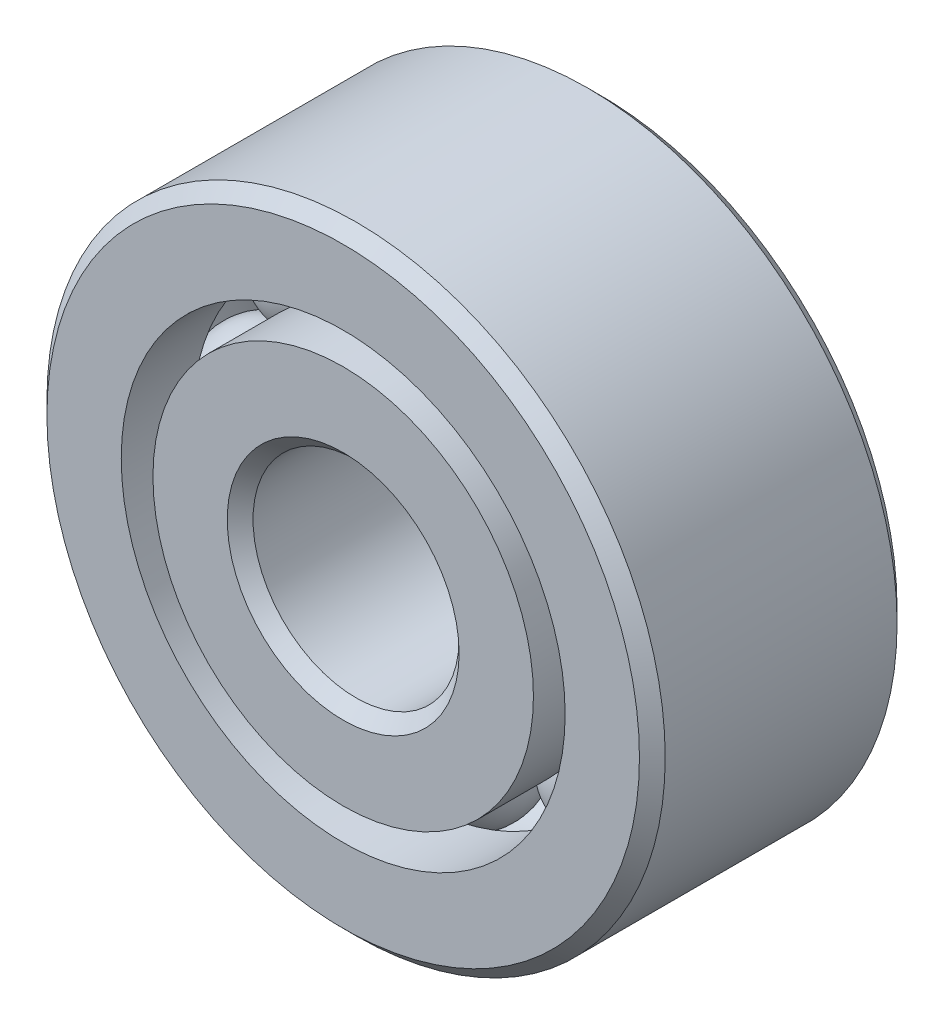
ISO-10303-21;
HEADER;
FILE_DESCRIPTION(('STEP AP214'),'2;1');
FILE_NAME('part.step','',(''),(''),'','','');
FILE_SCHEMA(('AUTOMOTIVE_DESIGN { 1 0 10303 214 1 1 1 1 }'));
ENDSEC;
DATA;
#1=APPLICATION_CONTEXT('core data for automotive mechanical design processes');
#2=APPLICATION_PROTOCOL_DEFINITION('international standard','automotive_design',2000,#1);
#3=PRODUCT_CONTEXT('',#1,'mechanical');
#4=PRODUCT('Part','Part','',(#3));
#5=PRODUCT_RELATED_PRODUCT_CATEGORY('part','',(#4));
#6=PRODUCT_DEFINITION_FORMATION('','',#4);
#7=PRODUCT_DEFINITION_CONTEXT('part definition',#1,'design');
#8=PRODUCT_DEFINITION('design','',#6,#7);
#9=PRODUCT_DEFINITION_SHAPE('','',#8);
#10=(LENGTH_UNIT() NAMED_UNIT(*) SI_UNIT(.MILLI.,.METRE.));
#11=(NAMED_UNIT(*) PLANE_ANGLE_UNIT() SI_UNIT($,.RADIAN.));
#12=(NAMED_UNIT(*) SI_UNIT($,.STERADIAN.) SOLID_ANGLE_UNIT());
#13=UNCERTAINTY_MEASURE_WITH_UNIT(LENGTH_MEASURE(1.E-05),#10,'distance_accuracy_value','');
#14=(GEOMETRIC_REPRESENTATION_CONTEXT(3) GLOBAL_UNCERTAINTY_ASSIGNED_CONTEXT((#13)) GLOBAL_UNIT_ASSIGNED_CONTEXT((#10,
#11,#12)) REPRESENTATION_CONTEXT('',''));
#15=CARTESIAN_POINT('',(0.,0.,0.));
#16=DIRECTION('',(0.,0.,1.));
#17=DIRECTION('',(1.,0.,0.));
#18=AXIS2_PLACEMENT_3D('',#15,#16,#17);
#19=CARTESIAN_POINT('',(-2.24506403026726,2.24506403026731,0.));
#20=DIRECTION('',(0.,0.,1.));
#21=DIRECTION('',(-0.707106781186539,0.707106781186556,0.));
#22=AXIS2_PLACEMENT_3D('',#19,#20,#21);
#23=SPHERICAL_SURFACE('',#22,0.915136422466877);
#24=CARTESIAN_POINT('',(-2.24506403026726,2.24506403026731,0.915136422466874));
#25=VERTEX_POINT('',#24);
#26=VERTEX_LOOP('',#25);
#27=FACE_BOUND('',#26,.T.);
#28=ADVANCED_FACE('F41',(#27),#23,.T.);
#29=CLOSED_SHELL('',(#28));
#30=MANIFOLD_SOLID_BREP('B2',#29);
#31=CARTESIAN_POINT('',(-3.175,0.,0.));
#32=DIRECTION('',(0.,0.,1.));
#33=DIRECTION('',(-1.,0.,0.));
#34=AXIS2_PLACEMENT_3D('',#31,#32,#33);
#35=SPHERICAL_SURFACE('',#34,0.915136422466877);
#36=CARTESIAN_POINT('',(-3.175,0.,0.915136422466874));
#37=VERTEX_POINT('',#36);
#38=VERTEX_LOOP('',#37);
#39=FACE_BOUND('',#38,.T.);
#40=ADVANCED_FACE('F61',(#39),#35,.T.);
#41=CLOSED_SHELL('',(#40));
#42=MANIFOLD_SOLID_BREP('B6',#41);
#43=CARTESIAN_POINT('',(-2.24506403026731,-2.24506403026727,0.));
#44=DIRECTION('',(0.,0.,1.));
#45=DIRECTION('',(-0.707106781186554,-0.707106781186541,0.));
#46=AXIS2_PLACEMENT_3D('',#43,#44,#45);
#47=SPHERICAL_SURFACE('',#46,0.915136422466877);
#48=CARTESIAN_POINT('',(-2.24506403026731,-2.24506403026727,0.915136422466874));
#49=VERTEX_POINT('',#48);
#50=VERTEX_LOOP('',#49);
#51=FACE_BOUND('',#50,.T.);
#52=ADVANCED_FACE('F81',(#51),#47,.T.);
#53=CLOSED_SHELL('',(#52));
#54=MANIFOLD_SOLID_BREP('B37',#53);
#55=CARTESIAN_POINT('',(0.,-3.175,0.));
#56=DIRECTION('',(0.,0.,1.));
#57=DIRECTION('',(0.,-1.,0.));
#58=AXIS2_PLACEMENT_3D('',#55,#56,#57);
#59=SPHERICAL_SURFACE('',#58,0.915136422466877);
#60=CARTESIAN_POINT('',(0.,-3.175,0.915136422466874));
#61=VERTEX_POINT('',#60);
#62=VERTEX_LOOP('',#61);
#63=FACE_BOUND('',#62,.T.);
#64=ADVANCED_FACE('F101',(#63),#59,.T.);
#65=CLOSED_SHELL('',(#64));
#66=MANIFOLD_SOLID_BREP('B57',#65);
#67=CARTESIAN_POINT('',(2.24506403026727,-2.2450640302673,0.));
#68=DIRECTION('',(0.,0.,1.));
#69=DIRECTION('',(0.707106781186544,-0.707106781186551,0.));
#70=AXIS2_PLACEMENT_3D('',#67,#68,#69);
#71=SPHERICAL_SURFACE('',#70,0.915136422466877);
#72=CARTESIAN_POINT('',(2.24506403026727,-2.2450640302673,0.915136422466874));
#73=VERTEX_POINT('',#72);
#74=VERTEX_LOOP('',#73);
#75=FACE_BOUND('',#74,.T.);
#76=ADVANCED_FACE('F121',(#75),#71,.T.);
#77=CLOSED_SHELL('',(#76));
#78=MANIFOLD_SOLID_BREP('B77',#77);
#79=CARTESIAN_POINT('',(3.175,0.,0.));
#80=DIRECTION('',(0.,0.,1.));
#81=DIRECTION('',(1.,0.,0.));
#82=AXIS2_PLACEMENT_3D('',#79,#80,#81);
#83=SPHERICAL_SURFACE('',#82,0.915136422466877);
#84=CARTESIAN_POINT('',(3.175,0.,0.915136422466874));
#85=VERTEX_POINT('',#84);
#86=VERTEX_LOOP('',#85);
#87=FACE_BOUND('',#86,.T.);
#88=ADVANCED_FACE('F141',(#87),#83,.T.);
#89=CLOSED_SHELL('',(#88));
#90=MANIFOLD_SOLID_BREP('B97',#89);
#91=CARTESIAN_POINT('',(2.24506403026729,2.24506403026728,0.));
#92=DIRECTION('',(0.,0.,1.));
#93=DIRECTION('',(0.707106781186549,0.707106781186546,0.));
#94=AXIS2_PLACEMENT_3D('',#91,#92,#93);
#95=SPHERICAL_SURFACE('',#94,0.915136422466877);
#96=CARTESIAN_POINT('',(2.24506403026729,2.24506403026728,0.915136422466874));
#97=VERTEX_POINT('',#96);
#98=VERTEX_LOOP('',#97);
#99=FACE_BOUND('',#98,.T.);
#100=ADVANCED_FACE('F161',(#99),#95,.T.);
#101=CLOSED_SHELL('',(#100));
#102=MANIFOLD_SOLID_BREP('B117',#101);
#103=CARTESIAN_POINT('',(0.,3.175,0.));
#104=DIRECTION('',(0.,0.,1.));
#105=DIRECTION('',(0.,1.,0.));
#106=AXIS2_PLACEMENT_3D('',#103,#104,#105);
#107=SPHERICAL_SURFACE('',#106,0.915136422466877);
#108=CARTESIAN_POINT('',(0.,3.175,0.915136422466874));
#109=VERTEX_POINT('',#108);
#110=VERTEX_LOOP('',#109);
#111=FACE_BOUND('',#110,.T.);
#112=ADVANCED_FACE('F183',(#111),#107,.T.);
#113=CLOSED_SHELL('',(#112));
#114=MANIFOLD_SOLID_BREP('B137',#113);
#115=CARTESIAN_POINT('',(0.,2.93076923076923,1.984375));
#116=DIRECTION('',(0.,0.,-1.));
#117=DIRECTION('',(-1.,0.,0.));
#118=AXIS2_PLACEMENT_3D('',#115,#116,#117);
#119=PLANE('',#118);
#120=CARTESIAN_POINT('',(0.,0.,1.984375));
#121=DIRECTION('',(0.,0.,1.));
#122=DIRECTION('',(1.,0.,0.));
#123=AXIS2_PLACEMENT_3D('',#120,#121,#122);
#124=CIRCLE('',#123,1.7859375);
#125=CARTESIAN_POINT('',(1.7859375,0.,1.984375));
#126=VERTEX_POINT('',#125);
#127=EDGE_CURVE('E230',#126,#126,#124,.T.);
#128=ORIENTED_EDGE('',*,*,#127,.F.);
#129=EDGE_LOOP('',(#128));
#130=FACE_BOUND('',#129,.T.);
#131=CARTESIAN_POINT('',(0.,0.,1.984375));
#132=DIRECTION('',(0.,0.,1.));
#133=DIRECTION('',(1.,0.,0.));
#134=AXIS2_PLACEMENT_3D('',#131,#132,#133);
#135=CIRCLE('',#134,2.93076923076923);
#136=CARTESIAN_POINT('',(2.93076923076923,0.,1.984375));
#137=VERTEX_POINT('',#136);
#138=EDGE_CURVE('E182',#137,#137,#135,.T.);
#139=ORIENTED_EDGE('',*,*,#138,.T.);
#140=EDGE_LOOP('',(#139));
#141=FACE_BOUND('',#140,.T.);
#142=ADVANCED_FACE('F202',(#130,#141),#119,.F.);
#143=CARTESIAN_POINT('',(0.,0.,1.984375));
#144=DIRECTION('',(0.,0.,1.));
#145=DIRECTION('',(1.,0.,0.));
#146=AXIS2_PLACEMENT_3D('',#143,#144,#145);
#147=CYLINDRICAL_SURFACE('',#146,2.93076923076923);
#148=ORIENTED_EDGE('',*,*,#138,.F.);
#149=EDGE_LOOP('',(#148));
#150=FACE_BOUND('',#149,.T.);
#151=CARTESIAN_POINT('',(0.,0.,0.881944444444442));
#152=DIRECTION('',(0.,0.,1.));
#153=DIRECTION('',(1.,0.,0.));
#154=AXIS2_PLACEMENT_3D('',#151,#152,#153);
#155=CIRCLE('',#154,2.93076923076923);
#156=CARTESIAN_POINT('',(2.93076923076923,0.,0.881944444444442));
#157=VERTEX_POINT('',#156);
#158=EDGE_CURVE('E208',#157,#157,#155,.T.);
#159=ORIENTED_EDGE('',*,*,#158,.T.);
#160=EDGE_LOOP('',(#159));
#161=FACE_BOUND('',#160,.T.);
#162=ADVANCED_FACE('F237',(#150,#161),#147,.T.);
#163=CARTESIAN_POINT('',(0.,0.,0.));
#164=DIRECTION('',(0.,0.,1.));
#165=DIRECTION('',(1.,0.,0.));
#166=AXIS2_PLACEMENT_3D('',#163,#164,#165);
#167=TOROIDAL_SURFACE('',#166,3.175,0.915136422466873);
#168=ORIENTED_EDGE('',*,*,#158,.F.);
#169=EDGE_LOOP('',(#168));
#170=FACE_BOUND('',#169,.T.);
#171=CARTESIAN_POINT('',(0.,0.,-0.881944444444445));
#172=DIRECTION('',(0.,0.,1.));
#173=DIRECTION('',(1.,0.,0.));
#174=AXIS2_PLACEMENT_3D('',#171,#172,#173);
#175=CIRCLE('',#174,2.93076923076923);
#176=CARTESIAN_POINT('',(2.93076923076923,0.,-0.881944444444445));
#177=VERTEX_POINT('',#176);
#178=EDGE_CURVE('E212',#177,#177,#175,.T.);
#179=ORIENTED_EDGE('',*,*,#178,.T.);
#180=EDGE_LOOP('',(#179));
#181=FACE_BOUND('',#180,.T.);
#182=ADVANCED_FACE('F241',(#170,#181),#167,.F.);
#183=CARTESIAN_POINT('',(0.,0.,1.984375));
#184=DIRECTION('',(0.,0.,1.));
#185=DIRECTION('',(1.,0.,0.));
#186=AXIS2_PLACEMENT_3D('',#183,#184,#185);
#187=CYLINDRICAL_SURFACE('',#186,2.93076923076923);
#188=ORIENTED_EDGE('',*,*,#178,.F.);
#189=EDGE_LOOP('',(#188));
#190=FACE_BOUND('',#189,.T.);
#191=CARTESIAN_POINT('',(0.,0.,-1.984375));
#192=DIRECTION('',(0.,0.,1.));
#193=DIRECTION('',(1.,0.,0.));
#194=AXIS2_PLACEMENT_3D('',#191,#192,#193);
#195=CIRCLE('',#194,2.93076923076923);
#196=CARTESIAN_POINT('',(2.93076923076923,0.,-1.984375));
#197=VERTEX_POINT('',#196);
#198=EDGE_CURVE('E216',#197,#197,#195,.T.);
#199=ORIENTED_EDGE('',*,*,#198,.T.);
#200=EDGE_LOOP('',(#199));
#201=FACE_BOUND('',#200,.T.);
#202=ADVANCED_FACE('F246',(#190,#201),#187,.T.);
#203=CARTESIAN_POINT('',(0.,1.7859375,-1.984375));
#204=DIRECTION('',(0.,0.,1.));
#205=DIRECTION('',(1.,0.,0.));
#206=AXIS2_PLACEMENT_3D('',#203,#204,#205);
#207=PLANE('',#206);
#208=ORIENTED_EDGE('',*,*,#198,.F.);
#209=EDGE_LOOP('',(#208));
#210=FACE_BOUND('',#209,.T.);
#211=CARTESIAN_POINT('',(0.,0.,-1.98437500000001));
#212=DIRECTION('',(0.,0.,1.));
#213=DIRECTION('',(1.,0.,0.));
#214=AXIS2_PLACEMENT_3D('',#211,#212,#213);
#215=CIRCLE('',#214,1.7859375);
#216=CARTESIAN_POINT('',(1.7859375,0.,-1.98437500000001));
#217=VERTEX_POINT('',#216);
#218=EDGE_CURVE('E221',#217,#217,#215,.T.);
#219=ORIENTED_EDGE('',*,*,#218,.T.);
#220=EDGE_LOOP('',(#219));
#221=FACE_BOUND('',#220,.T.);
#222=ADVANCED_FACE('F252',(#210,#221),#207,.F.);
#223=CARTESIAN_POINT('',(0.,0.,-1.78593750000001));
#224=DIRECTION('',(0.,0.,-1.));
#225=DIRECTION('',(-1.,0.,0.));
#226=AXIS2_PLACEMENT_3D('',#223,#224,#225);
#227=CONICAL_SURFACE('',#226,1.5875,0.785398163397446);
#228=ORIENTED_EDGE('',*,*,#218,.F.);
#229=EDGE_LOOP('',(#228));
#230=FACE_BOUND('',#229,.T.);
#231=CARTESIAN_POINT('',(0.,0.,-1.78593750000001));
#232=DIRECTION('',(0.,0.,1.));
#233=DIRECTION('',(1.,0.,0.));
#234=AXIS2_PLACEMENT_3D('',#231,#232,#233);
#235=CIRCLE('',#234,1.5875);
#236=CARTESIAN_POINT('',(1.5875,0.,-1.78593750000001));
#237=VERTEX_POINT('',#236);
#238=EDGE_CURVE('E224',#237,#237,#235,.T.);
#239=ORIENTED_EDGE('',*,*,#238,.T.);
#240=EDGE_LOOP('',(#239));
#241=FACE_BOUND('',#240,.T.);
#242=ADVANCED_FACE('F256',(#230,#241),#227,.F.);
#243=CARTESIAN_POINT('',(0.,0.,1.984375));
#244=DIRECTION('',(0.,0.,1.));
#245=DIRECTION('',(1.,0.,0.));
#246=AXIS2_PLACEMENT_3D('',#243,#244,#245);
#247=CYLINDRICAL_SURFACE('',#246,1.5875);
#248=ORIENTED_EDGE('',*,*,#238,.F.);
#249=EDGE_LOOP('',(#248));
#250=FACE_BOUND('',#249,.T.);
#251=CARTESIAN_POINT('',(0.,0.,1.7859375));
#252=DIRECTION('',(0.,0.,1.));
#253=DIRECTION('',(1.,0.,0.));
#254=AXIS2_PLACEMENT_3D('',#251,#252,#253);
#255=CIRCLE('',#254,1.5875);
#256=CARTESIAN_POINT('',(1.5875,0.,1.7859375));
#257=VERTEX_POINT('',#256);
#258=EDGE_CURVE('E227',#257,#257,#255,.T.);
#259=ORIENTED_EDGE('',*,*,#258,.T.);
#260=EDGE_LOOP('',(#259));
#261=FACE_BOUND('',#260,.T.);
#262=ADVANCED_FACE('F260',(#250,#261),#247,.F.);
#263=CARTESIAN_POINT('',(0.,0.,1.984375));
#264=DIRECTION('',(0.,0.,1.));
#265=DIRECTION('',(1.,0.,0.));
#266=AXIS2_PLACEMENT_3D('',#263,#264,#265);
#267=CONICAL_SURFACE('',#266,1.7859375,0.785398163397446);
#268=ORIENTED_EDGE('',*,*,#258,.F.);
#269=EDGE_LOOP('',(#268));
#270=FACE_BOUND('',#269,.T.);
#271=ORIENTED_EDGE('',*,*,#127,.T.);
#272=EDGE_LOOP('',(#271));
#273=FACE_BOUND('',#272,.T.);
#274=ADVANCED_FACE('F234',(#270,#273),#267,.F.);
#275=CLOSED_SHELL('',(#142,#162,#182,#202,#222,#242,#262,#274));
#276=MANIFOLD_SOLID_BREP('B157',#275);
#277=CARTESIAN_POINT('',(0.,0.,1.7859375));
#278=DIRECTION('',(0.,0.,-1.));
#279=DIRECTION('',(-1.,0.,0.));
#280=AXIS2_PLACEMENT_3D('',#277,#278,#279);
#281=CONICAL_SURFACE('',#280,4.7625,0.785398163397446);
#282=CARTESIAN_POINT('',(0.,0.,1.984375));
#283=DIRECTION('',(0.,0.,1.));
#284=DIRECTION('',(1.,0.,0.));
#285=AXIS2_PLACEMENT_3D('',#282,#283,#284);
#286=CIRCLE('',#285,4.5640625);
#287=CARTESIAN_POINT('',(4.5640625,0.,1.984375));
#288=VERTEX_POINT('',#287);
#289=EDGE_CURVE('E351',#288,#288,#286,.T.);
#290=ORIENTED_EDGE('',*,*,#289,.F.);
#291=EDGE_LOOP('',(#290));
#292=FACE_BOUND('',#291,.T.);
#293=CARTESIAN_POINT('',(0.,0.,1.7859375));
#294=DIRECTION('',(0.,0.,1.));
#295=DIRECTION('',(1.,0.,0.));
#296=AXIS2_PLACEMENT_3D('',#293,#294,#295);
#297=CIRCLE('',#296,4.7625);
#298=CARTESIAN_POINT('',(4.7625,0.,1.7859375));
#299=VERTEX_POINT('',#298);
#300=EDGE_CURVE('E201',#299,#299,#297,.T.);
#301=ORIENTED_EDGE('',*,*,#300,.T.);
#302=EDGE_LOOP('',(#301));
#303=FACE_BOUND('',#302,.T.);
#304=ADVANCED_FACE('F323',(#292,#303),#281,.T.);
#305=CARTESIAN_POINT('',(0.,0.,1.984375));
#306=DIRECTION('',(0.,0.,1.));
#307=DIRECTION('',(1.,0.,0.));
#308=AXIS2_PLACEMENT_3D('',#305,#306,#307);
#309=CYLINDRICAL_SURFACE('',#308,4.7625);
#310=ORIENTED_EDGE('',*,*,#300,.F.);
#311=EDGE_LOOP('',(#310));
#312=FACE_BOUND('',#311,.T.);
#313=CARTESIAN_POINT('',(0.,0.,-1.78593750000001));
#314=DIRECTION('',(0.,0.,1.));
#315=DIRECTION('',(1.,0.,0.));
#316=AXIS2_PLACEMENT_3D('',#313,#314,#315);
#317=CIRCLE('',#316,4.7625);
#318=CARTESIAN_POINT('',(4.7625,0.,-1.78593750000001));
#319=VERTEX_POINT('',#318);
#320=EDGE_CURVE('E329',#319,#319,#317,.T.);
#321=ORIENTED_EDGE('',*,*,#320,.T.);
#322=EDGE_LOOP('',(#321));
#323=FACE_BOUND('',#322,.T.);
#324=ADVANCED_FACE('F358',(#312,#323),#309,.T.);
#325=CARTESIAN_POINT('',(0.,0.,-1.98437500000001));
#326=DIRECTION('',(0.,0.,1.));
#327=DIRECTION('',(1.,0.,0.));
#328=AXIS2_PLACEMENT_3D('',#325,#326,#327);
#329=CONICAL_SURFACE('',#328,4.5640625,0.785398163397446);
#330=ORIENTED_EDGE('',*,*,#320,.F.);
#331=EDGE_LOOP('',(#330));
#332=FACE_BOUND('',#331,.T.);
#333=CARTESIAN_POINT('',(0.,0.,-1.98437500000001));
#334=DIRECTION('',(0.,0.,1.));
#335=DIRECTION('',(1.,0.,0.));
#336=AXIS2_PLACEMENT_3D('',#333,#334,#335);
#337=CIRCLE('',#336,4.5640625);
#338=CARTESIAN_POINT('',(4.5640625,0.,-1.98437500000001));
#339=VERTEX_POINT('',#338);
#340=EDGE_CURVE('E333',#339,#339,#337,.T.);
#341=ORIENTED_EDGE('',*,*,#340,.T.);
#342=EDGE_LOOP('',(#341));
#343=FACE_BOUND('',#342,.T.);
#344=ADVANCED_FACE('F362',(#332,#343),#329,.T.);
#345=CARTESIAN_POINT('',(0.,4.5640625,-1.98437500000001));
#346=DIRECTION('',(0.,0.,1.));
#347=DIRECTION('',(1.,0.,0.));
#348=AXIS2_PLACEMENT_3D('',#345,#346,#347);
#349=PLANE('',#348);
#350=ORIENTED_EDGE('',*,*,#340,.F.);
#351=EDGE_LOOP('',(#350));
#352=FACE_BOUND('',#351,.T.);
#353=CARTESIAN_POINT('',(0.,0.,-1.98437500000001));
#354=DIRECTION('',(0.,0.,1.));
#355=DIRECTION('',(1.,0.,0.));
#356=AXIS2_PLACEMENT_3D('',#353,#354,#355);
#357=CIRCLE('',#356,3.41923076923077);
#358=CARTESIAN_POINT('',(3.41923076923077,0.,-1.98437500000001));
#359=VERTEX_POINT('',#358);
#360=EDGE_CURVE('E337',#359,#359,#357,.T.);
#361=ORIENTED_EDGE('',*,*,#360,.T.);
#362=EDGE_LOOP('',(#361));
#363=FACE_BOUND('',#362,.T.);
#364=ADVANCED_FACE('F367',(#352,#363),#349,.F.);
#365=CARTESIAN_POINT('',(0.,0.,1.984375));
#366=DIRECTION('',(0.,0.,1.));
#367=DIRECTION('',(1.,0.,0.));
#368=AXIS2_PLACEMENT_3D('',#365,#366,#367);
#369=CYLINDRICAL_SURFACE('',#368,3.41923076923077);
#370=ORIENTED_EDGE('',*,*,#360,.F.);
#371=EDGE_LOOP('',(#370));
#372=FACE_BOUND('',#371,.T.);
#373=CARTESIAN_POINT('',(0.,0.,-0.881944444444447));
#374=DIRECTION('',(0.,0.,1.));
#375=DIRECTION('',(1.,0.,0.));
#376=AXIS2_PLACEMENT_3D('',#373,#374,#375);
#377=CIRCLE('',#376,3.41923076923077);
#378=CARTESIAN_POINT('',(3.41923076923077,0.,-0.881944444444447));
#379=VERTEX_POINT('',#378);
#380=EDGE_CURVE('E342',#379,#379,#377,.T.);
#381=ORIENTED_EDGE('',*,*,#380,.T.);
#382=EDGE_LOOP('',(#381));
#383=FACE_BOUND('',#382,.T.);
#384=ADVANCED_FACE('F373',(#372,#383),#369,.F.);
#385=CARTESIAN_POINT('',(0.,0.,0.));
#386=DIRECTION('',(0.,0.,1.));
#387=DIRECTION('',(1.,0.,0.));
#388=AXIS2_PLACEMENT_3D('',#385,#386,#387);
#389=TOROIDAL_SURFACE('',#388,3.175,0.915136422466877);
#390=ORIENTED_EDGE('',*,*,#380,.F.);
#391=EDGE_LOOP('',(#390));
#392=FACE_BOUND('',#391,.T.);
#393=CARTESIAN_POINT('',(0.,0.,0.881944444444442));
#394=DIRECTION('',(0.,0.,1.));
#395=DIRECTION('',(1.,0.,0.));
#396=AXIS2_PLACEMENT_3D('',#393,#394,#395);
#397=CIRCLE('',#396,3.41923076923077);
#398=CARTESIAN_POINT('',(3.41923076923077,0.,0.881944444444442));
#399=VERTEX_POINT('',#398);
#400=EDGE_CURVE('E345',#399,#399,#397,.T.);
#401=ORIENTED_EDGE('',*,*,#400,.T.);
#402=EDGE_LOOP('',(#401));
#403=FACE_BOUND('',#402,.T.);
#404=ADVANCED_FACE('F377',(#392,#403),#389,.F.);
#405=CARTESIAN_POINT('',(0.,0.,1.984375));
#406=DIRECTION('',(0.,0.,1.));
#407=DIRECTION('',(1.,0.,0.));
#408=AXIS2_PLACEMENT_3D('',#405,#406,#407);
#409=CYLINDRICAL_SURFACE('',#408,3.41923076923077);
#410=ORIENTED_EDGE('',*,*,#400,.F.);
#411=EDGE_LOOP('',(#410));
#412=FACE_BOUND('',#411,.T.);
#413=CARTESIAN_POINT('',(0.,0.,1.984375));
#414=DIRECTION('',(0.,0.,1.));
#415=DIRECTION('',(1.,0.,0.));
#416=AXIS2_PLACEMENT_3D('',#413,#414,#415);
#417=CIRCLE('',#416,3.41923076923077);
#418=CARTESIAN_POINT('',(3.41923076923077,0.,1.984375));
#419=VERTEX_POINT('',#418);
#420=EDGE_CURVE('E348',#419,#419,#417,.T.);
#421=ORIENTED_EDGE('',*,*,#420,.T.);
#422=EDGE_LOOP('',(#421));
#423=FACE_BOUND('',#422,.T.);
#424=ADVANCED_FACE('F381',(#412,#423),#409,.F.);
#425=CARTESIAN_POINT('',(0.,4.5640625,1.984375));
#426=DIRECTION('',(0.,0.,-1.));
#427=DIRECTION('',(-1.,0.,0.));
#428=AXIS2_PLACEMENT_3D('',#425,#426,#427);
#429=PLANE('',#428);
#430=ORIENTED_EDGE('',*,*,#420,.F.);
#431=EDGE_LOOP('',(#430));
#432=FACE_BOUND('',#431,.T.);
#433=ORIENTED_EDGE('',*,*,#289,.T.);
#434=EDGE_LOOP('',(#433));
#435=FACE_BOUND('',#434,.T.);
#436=ADVANCED_FACE('F355',(#432,#435),#429,.F.);
#437=CLOSED_SHELL('',(#304,#324,#344,#364,#384,#404,#424,#436));
#438=MANIFOLD_SOLID_BREP('B177',#437);
#439=ADVANCED_BREP_SHAPE_REPRESENTATION('',(#18,#30,#42,#54,#66,#78,#90,#102,#114,#276,#438),#14);
#440=SHAPE_DEFINITION_REPRESENTATION(#9,#439);
ENDSEC;
END-ISO-10303-21;
